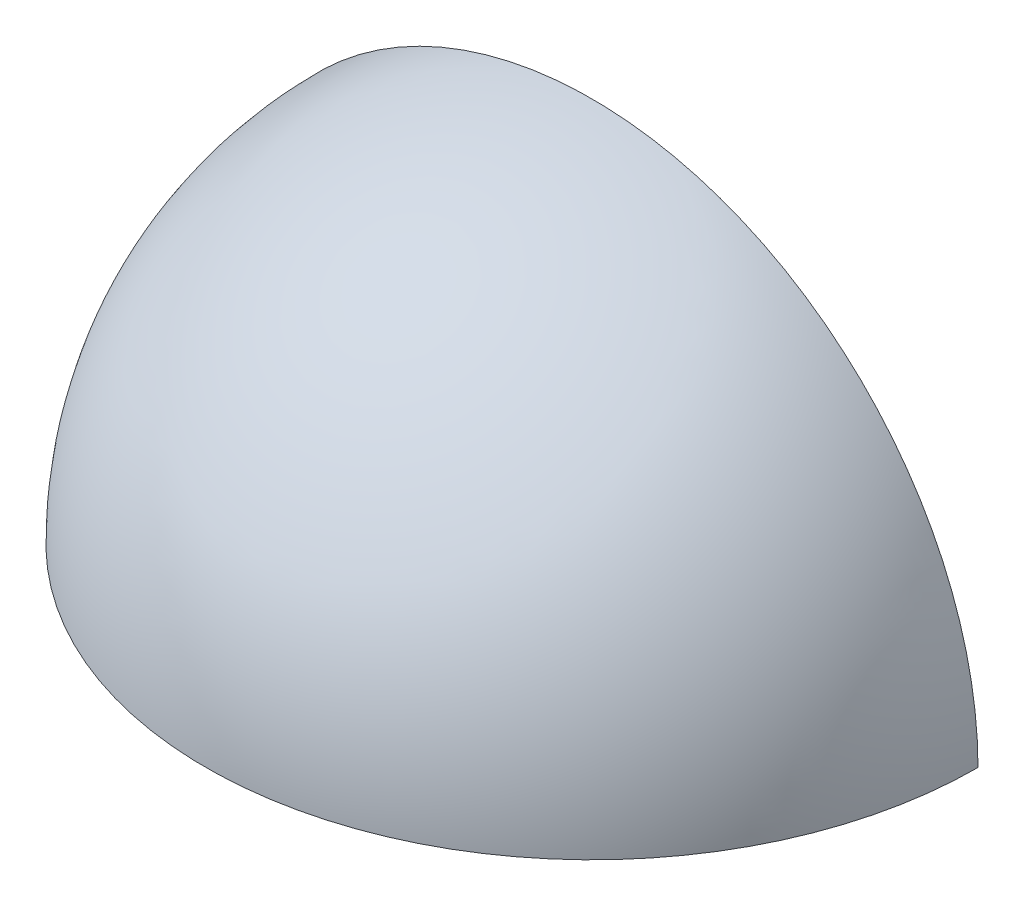
ISO-10303-21;
HEADER;
FILE_DESCRIPTION(('STEP AP214'),'2;1');
FILE_NAME('part.step','',(''),(''),'','','');
FILE_SCHEMA(('AUTOMOTIVE_DESIGN { 1 0 10303 214 1 1 1 1 }'));
ENDSEC;
DATA;
#1=APPLICATION_CONTEXT('core data for automotive mechanical design processes');
#2=APPLICATION_PROTOCOL_DEFINITION('international standard','automotive_design',2000,#1);
#3=PRODUCT_CONTEXT('',#1,'mechanical');
#4=PRODUCT('Part','Part','',(#3));
#5=PRODUCT_RELATED_PRODUCT_CATEGORY('part','',(#4));
#6=PRODUCT_DEFINITION_FORMATION('','',#4);
#7=PRODUCT_DEFINITION_CONTEXT('part definition',#1,'design');
#8=PRODUCT_DEFINITION('design','',#6,#7);
#9=PRODUCT_DEFINITION_SHAPE('','',#8);
#10=(LENGTH_UNIT() NAMED_UNIT(*) SI_UNIT(.MILLI.,.METRE.));
#11=(NAMED_UNIT(*) PLANE_ANGLE_UNIT() SI_UNIT($,.RADIAN.));
#12=(NAMED_UNIT(*) SI_UNIT($,.STERADIAN.) SOLID_ANGLE_UNIT());
#13=UNCERTAINTY_MEASURE_WITH_UNIT(LENGTH_MEASURE(1.E-05),#10,'distance_accuracy_value','');
#14=(GEOMETRIC_REPRESENTATION_CONTEXT(3) GLOBAL_UNCERTAINTY_ASSIGNED_CONTEXT((#13)) GLOBAL_UNIT_ASSIGNED_CONTEXT((#10,
#11,#12)) REPRESENTATION_CONTEXT('',''));
#15=CARTESIAN_POINT('',(0.,0.,0.));
#16=DIRECTION('',(0.,0.,1.));
#17=DIRECTION('',(1.,0.,0.));
#18=AXIS2_PLACEMENT_3D('',#15,#16,#17);
#19=CARTESIAN_POINT('',(0.,0.,0.));
#20=DIRECTION('',(-1.,0.,0.));
#21=DIRECTION('',(0.,0.,1.));
#22=AXIS2_PLACEMENT_3D('',#19,#20,#21);
#23=SPHERICAL_SURFACE('',#22,30.);
#24=CARTESIAN_POINT('',(0.,0.,0.));
#25=DIRECTION('',(0.,0.,1.));
#26=DIRECTION('',(1.,0.,0.));
#27=AXIS2_PLACEMENT_3D('',#24,#25,#26);
#28=CIRCLE('',#27,30.);
#29=CARTESIAN_POINT('',(30.,0.,0.));
#30=VERTEX_POINT('',#29);
#31=CARTESIAN_POINT('',(-30.,0.,0.));
#32=VERTEX_POINT('',#31);
#33=EDGE_CURVE('E48',#30,#32,#28,.T.);
#34=ORIENTED_EDGE('',*,*,#33,.T.);
#35=CARTESIAN_POINT('',(0.,0.,0.));
#36=DIRECTION('',(0.,-1.,0.));
#37=DIRECTION('',(1.,0.,0.));
#38=AXIS2_PLACEMENT_3D('',#35,#36,#37);
#39=CIRCLE('',#38,30.);
#40=EDGE_CURVE('E64',#30,#32,#39,.T.);
#41=ORIENTED_EDGE('',*,*,#40,.F.);
#42=EDGE_LOOP('',(#34,#41));
#43=FACE_BOUND('',#42,.T.);
#44=ADVANCED_FACE('F33',(#43),#23,.T.);
#45=CARTESIAN_POINT('',(0.,0.,0.));
#46=DIRECTION('',(-1.,0.,0.));
#47=DIRECTION('',(0.,0.,-1.));
#48=AXIS2_PLACEMENT_3D('',#45,#46,#47);
#49=SPHERICAL_SURFACE('',#48,28.5);
#50=CARTESIAN_POINT('',(0.,0.,0.));
#51=DIRECTION('',(0.,0.,-1.));
#52=DIRECTION('',(1.,0.,0.));
#53=AXIS2_PLACEMENT_3D('',#50,#51,#52);
#54=CIRCLE('',#53,28.5);
#55=CARTESIAN_POINT('',(-28.5,0.,0.));
#56=VERTEX_POINT('',#55);
#57=CARTESIAN_POINT('',(28.5,0.,0.));
#58=VERTEX_POINT('',#57);
#59=EDGE_CURVE('E59',#56,#58,#54,.T.);
#60=ORIENTED_EDGE('',*,*,#59,.T.);
#61=CARTESIAN_POINT('',(0.,0.,0.));
#62=DIRECTION('',(0.,1.,0.));
#63=DIRECTION('',(1.,0.,0.));
#64=AXIS2_PLACEMENT_3D('',#61,#62,#63);
#65=CIRCLE('',#64,28.5);
#66=EDGE_CURVE('E41',#56,#58,#65,.T.);
#67=ORIENTED_EDGE('',*,*,#66,.F.);
#68=EDGE_LOOP('',(#60,#67));
#69=FACE_BOUND('',#68,.T.);
#70=ADVANCED_FACE('F35',(#69),#49,.F.);
#71=CARTESIAN_POINT('',(0.,0.,0.));
#72=DIRECTION('',(0.,-1.,0.));
#73=DIRECTION('',(1.,0.,0.));
#74=AXIS2_PLACEMENT_3D('',#71,#72,#73);
#75=PLANE('',#74);
#76=ORIENTED_EDGE('',*,*,#40,.T.);
#77=DIRECTION('',(1.,0.,0.));
#78=VECTOR('',#77,1.);
#79=CARTESIAN_POINT('',(-30.,0.,0.));
#80=LINE('',#79,#78);
#81=EDGE_CURVE('E57',#32,#56,#80,.T.);
#82=ORIENTED_EDGE('',*,*,#81,.T.);
#83=ORIENTED_EDGE('',*,*,#66,.T.);
#84=DIRECTION('',(1.,0.,0.));
#85=VECTOR('',#84,1.);
#86=CARTESIAN_POINT('',(28.5,0.,0.));
#87=LINE('',#86,#85);
#88=EDGE_CURVE('E11',#58,#30,#87,.T.);
#89=ORIENTED_EDGE('',*,*,#88,.T.);
#90=EDGE_LOOP('',(#76,#82,#83,#89));
#91=FACE_BOUND('',#90,.T.);
#92=ADVANCED_FACE('F68',(#91),#75,.T.);
#93=CARTESIAN_POINT('',(0.,0.,0.));
#94=DIRECTION('',(0.,0.,1.));
#95=DIRECTION('',(1.,0.,0.));
#96=AXIS2_PLACEMENT_3D('',#93,#94,#95);
#97=PLANE('',#96);
#98=ORIENTED_EDGE('',*,*,#33,.F.);
#99=ORIENTED_EDGE('',*,*,#88,.F.);
#100=ORIENTED_EDGE('',*,*,#59,.F.);
#101=ORIENTED_EDGE('',*,*,#81,.F.);
#102=EDGE_LOOP('',(#98,#99,#100,#101));
#103=FACE_BOUND('',#102,.T.);
#104=ADVANCED_FACE('F58',(#103),#97,.F.);
#105=CLOSED_SHELL('',(#44,#70,#92,#104));
#106=MANIFOLD_SOLID_BREP('B2',#105);
#107=ADVANCED_BREP_SHAPE_REPRESENTATION('',(#18,#106),#14);
#108=SHAPE_DEFINITION_REPRESENTATION(#9,#107);
ENDSEC;
END-ISO-10303-21;
